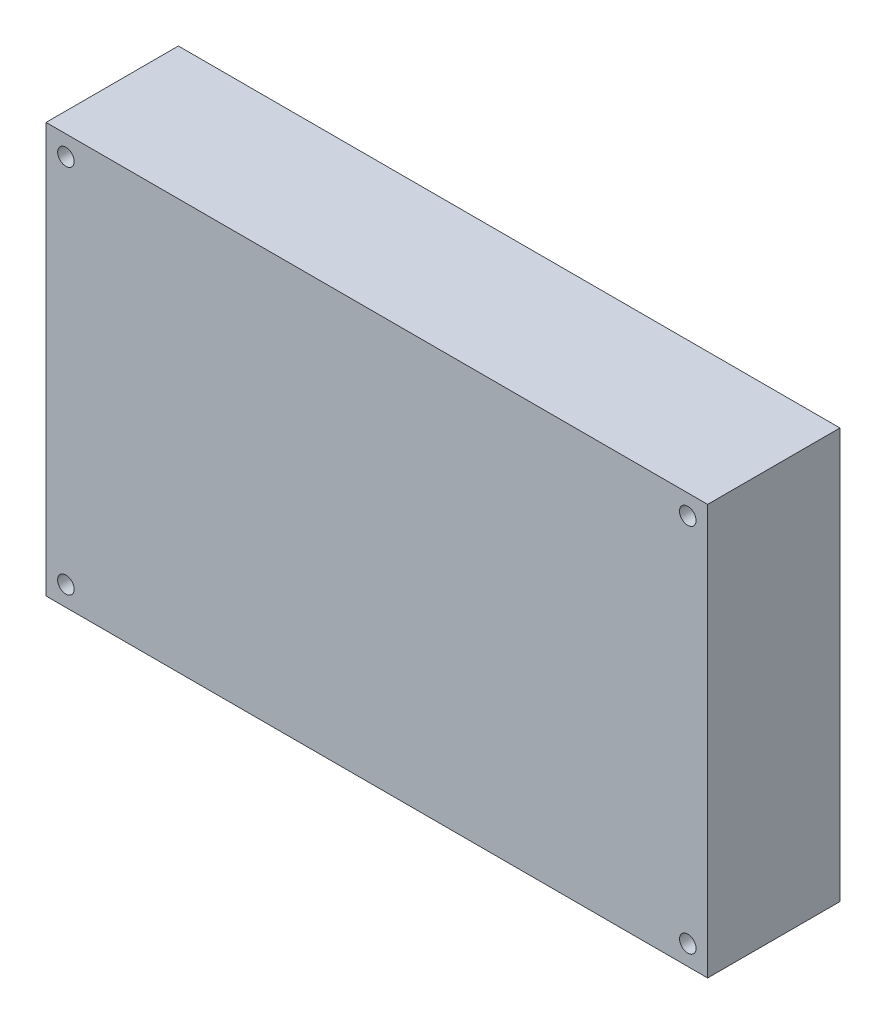
ISO-10303-21;
HEADER;
FILE_DESCRIPTION(('STEP AP214'),'2;1');
FILE_NAME('part.step','',(''),(''),'','','');
FILE_SCHEMA(('AUTOMOTIVE_DESIGN { 1 0 10303 214 1 1 1 1 }'));
ENDSEC;
DATA;
#1=APPLICATION_CONTEXT('core data for automotive mechanical design processes');
#2=APPLICATION_PROTOCOL_DEFINITION('international standard','automotive_design',2000,#1);
#3=PRODUCT_CONTEXT('',#1,'mechanical');
#4=PRODUCT('Part','Part','',(#3));
#5=PRODUCT_RELATED_PRODUCT_CATEGORY('part','',(#4));
#6=PRODUCT_DEFINITION_FORMATION('','',#4);
#7=PRODUCT_DEFINITION_CONTEXT('part definition',#1,'design');
#8=PRODUCT_DEFINITION('design','',#6,#7);
#9=PRODUCT_DEFINITION_SHAPE('','',#8);
#10=(LENGTH_UNIT() NAMED_UNIT(*) SI_UNIT(.MILLI.,.METRE.));
#11=(NAMED_UNIT(*) PLANE_ANGLE_UNIT() SI_UNIT($,.RADIAN.));
#12=(NAMED_UNIT(*) SI_UNIT($,.STERADIAN.) SOLID_ANGLE_UNIT());
#13=UNCERTAINTY_MEASURE_WITH_UNIT(LENGTH_MEASURE(1.E-05),#10,'distance_accuracy_value','');
#14=(GEOMETRIC_REPRESENTATION_CONTEXT(3) GLOBAL_UNCERTAINTY_ASSIGNED_CONTEXT((#13)) GLOBAL_UNIT_ASSIGNED_CONTEXT((#10,
#11,#12)) REPRESENTATION_CONTEXT('',''));
#15=CARTESIAN_POINT('',(0.,0.,0.));
#16=DIRECTION('',(0.,0.,1.));
#17=DIRECTION('',(1.,0.,0.));
#18=AXIS2_PLACEMENT_3D('',#15,#16,#17);
#19=CARTESIAN_POINT('',(50.,-31.,20.));
#20=DIRECTION('',(-1.,0.,0.));
#21=DIRECTION('',(0.,0.,1.));
#22=AXIS2_PLACEMENT_3D('',#19,#20,#21);
#23=PLANE('',#22);
#24=DIRECTION('',(0.,1.,0.));
#25=VECTOR('',#24,1.);
#26=CARTESIAN_POINT('',(50.,-31.,0.));
#27=LINE('',#26,#25);
#28=CARTESIAN_POINT('',(50.,-31.,0.));
#29=VERTEX_POINT('',#28);
#30=CARTESIAN_POINT('',(50.,31.,0.));
#31=VERTEX_POINT('',#30);
#32=EDGE_CURVE('E109',#29,#31,#27,.T.);
#33=ORIENTED_EDGE('',*,*,#32,.T.);
#34=DIRECTION('',(0.,0.,-1.));
#35=VECTOR('',#34,1.);
#36=CARTESIAN_POINT('',(50.,31.,20.));
#37=LINE('',#36,#35);
#38=CARTESIAN_POINT('',(50.,31.,20.));
#39=VERTEX_POINT('',#38);
#40=EDGE_CURVE('E11',#39,#31,#37,.T.);
#41=ORIENTED_EDGE('',*,*,#40,.F.);
#42=DIRECTION('',(0.,1.,0.));
#43=VECTOR('',#42,1.);
#44=CARTESIAN_POINT('',(50.,-31.,20.));
#45=LINE('',#44,#43);
#46=CARTESIAN_POINT('',(50.,-31.,20.));
#47=VERTEX_POINT('',#46);
#48=EDGE_CURVE('E93',#47,#39,#45,.T.);
#49=ORIENTED_EDGE('',*,*,#48,.F.);
#50=DIRECTION('',(0.,0.,-1.));
#51=VECTOR('',#50,1.);
#52=CARTESIAN_POINT('',(50.,-31.,20.));
#53=LINE('',#52,#51);
#54=EDGE_CURVE('E105',#47,#29,#53,.T.);
#55=ORIENTED_EDGE('',*,*,#54,.T.);
#56=EDGE_LOOP('',(#33,#41,#49,#55));
#57=FACE_BOUND('',#56,.T.);
#58=ADVANCED_FACE('F41',(#57),#23,.F.);
#59=CARTESIAN_POINT('',(-50.,31.,20.));
#60=DIRECTION('',(0.,-1.,0.));
#61=DIRECTION('',(1.,0.,0.));
#62=AXIS2_PLACEMENT_3D('',#59,#60,#61);
#63=PLANE('',#62);
#64=DIRECTION('',(-1.,0.,0.));
#65=VECTOR('',#64,1.);
#66=CARTESIAN_POINT('',(-50.,31.,0.));
#67=LINE('',#66,#65);
#68=CARTESIAN_POINT('',(-50.,31.,0.));
#69=VERTEX_POINT('',#68);
#70=EDGE_CURVE('E98',#31,#69,#67,.T.);
#71=ORIENTED_EDGE('',*,*,#70,.T.);
#72=DIRECTION('',(0.,0.,-1.));
#73=VECTOR('',#72,1.);
#74=CARTESIAN_POINT('',(-50.,31.,20.));
#75=LINE('',#74,#73);
#76=CARTESIAN_POINT('',(-50.,31.,20.));
#77=VERTEX_POINT('',#76);
#78=EDGE_CURVE('E50',#77,#69,#75,.T.);
#79=ORIENTED_EDGE('',*,*,#78,.F.);
#80=DIRECTION('',(-1.,0.,0.));
#81=VECTOR('',#80,1.);
#82=CARTESIAN_POINT('',(-50.,31.,20.));
#83=LINE('',#82,#81);
#84=EDGE_CURVE('E88',#39,#77,#83,.T.);
#85=ORIENTED_EDGE('',*,*,#84,.F.);
#86=ORIENTED_EDGE('',*,*,#40,.T.);
#87=EDGE_LOOP('',(#71,#79,#85,#86));
#88=FACE_BOUND('',#87,.T.);
#89=ADVANCED_FACE('F97',(#88),#63,.F.);
#90=CARTESIAN_POINT('',(-50.,-31.,20.));
#91=DIRECTION('',(1.,0.,0.));
#92=DIRECTION('',(0.,0.,-1.));
#93=AXIS2_PLACEMENT_3D('',#90,#91,#92);
#94=PLANE('',#93);
#95=DIRECTION('',(0.,-1.,0.));
#96=VECTOR('',#95,1.);
#97=CARTESIAN_POINT('',(-50.,-31.,0.));
#98=LINE('',#97,#96);
#99=CARTESIAN_POINT('',(-50.,-31.,0.));
#100=VERTEX_POINT('',#99);
#101=EDGE_CURVE('E75',#69,#100,#98,.T.);
#102=ORIENTED_EDGE('',*,*,#101,.T.);
#103=DIRECTION('',(0.,0.,-1.));
#104=VECTOR('',#103,1.);
#105=CARTESIAN_POINT('',(-50.,-31.,20.));
#106=LINE('',#105,#104);
#107=CARTESIAN_POINT('',(-50.,-31.,20.));
#108=VERTEX_POINT('',#107);
#109=EDGE_CURVE('E100',#108,#100,#106,.T.);
#110=ORIENTED_EDGE('',*,*,#109,.F.);
#111=DIRECTION('',(0.,-1.,0.));
#112=VECTOR('',#111,1.);
#113=CARTESIAN_POINT('',(-50.,-31.,20.));
#114=LINE('',#113,#112);
#115=EDGE_CURVE('E91',#77,#108,#114,.T.);
#116=ORIENTED_EDGE('',*,*,#115,.F.);
#117=ORIENTED_EDGE('',*,*,#78,.T.);
#118=EDGE_LOOP('',(#102,#110,#116,#117));
#119=FACE_BOUND('',#118,.T.);
#120=ADVANCED_FACE('F101',(#119),#94,.F.);
#121=CARTESIAN_POINT('',(-50.,-31.,20.));
#122=DIRECTION('',(0.,1.,0.));
#123=DIRECTION('',(-1.,0.,0.));
#124=AXIS2_PLACEMENT_3D('',#121,#122,#123);
#125=PLANE('',#124);
#126=DIRECTION('',(1.,0.,0.));
#127=VECTOR('',#126,1.);
#128=CARTESIAN_POINT('',(-50.,-31.,0.));
#129=LINE('',#128,#127);
#130=EDGE_CURVE('E81',#100,#29,#129,.T.);
#131=ORIENTED_EDGE('',*,*,#130,.T.);
#132=ORIENTED_EDGE('',*,*,#54,.F.);
#133=DIRECTION('',(1.,0.,0.));
#134=VECTOR('',#133,1.);
#135=CARTESIAN_POINT('',(-50.,-31.,20.));
#136=LINE('',#135,#134);
#137=EDGE_CURVE('E58',#108,#47,#136,.T.);
#138=ORIENTED_EDGE('',*,*,#137,.F.);
#139=ORIENTED_EDGE('',*,*,#109,.T.);
#140=EDGE_LOOP('',(#131,#132,#138,#139));
#141=FACE_BOUND('',#140,.T.);
#142=ADVANCED_FACE('F123',(#141),#125,.F.);
#143=CARTESIAN_POINT('',(0.,0.,20.));
#144=DIRECTION('',(0.,0.,-1.));
#145=DIRECTION('',(-1.,0.,0.));
#146=AXIS2_PLACEMENT_3D('',#143,#144,#145);
#147=PLANE('',#146);
#148=CARTESIAN_POINT('',(-47.,28.,20.));
#149=DIRECTION('',(0.,0.,1.));
#150=DIRECTION('',(1.,0.,0.));
#151=AXIS2_PLACEMENT_3D('',#148,#149,#150);
#152=CIRCLE('',#151,1.24999999999999);
#153=CARTESIAN_POINT('',(-45.75,28.,20.));
#154=VERTEX_POINT('',#153);
#155=EDGE_CURVE('E157',#154,#154,#152,.T.);
#156=ORIENTED_EDGE('',*,*,#155,.F.);
#157=EDGE_LOOP('',(#156));
#158=FACE_BOUND('',#157,.T.);
#159=CARTESIAN_POINT('',(-47.,-28.,20.));
#160=DIRECTION('',(0.,0.,1.));
#161=DIRECTION('',(1.,0.,0.));
#162=AXIS2_PLACEMENT_3D('',#159,#160,#161);
#163=CIRCLE('',#162,1.24999999999999);
#164=CARTESIAN_POINT('',(-45.75,-28.,20.));
#165=VERTEX_POINT('',#164);
#166=EDGE_CURVE('E149',#165,#165,#163,.T.);
#167=ORIENTED_EDGE('',*,*,#166,.F.);
#168=EDGE_LOOP('',(#167));
#169=FACE_BOUND('',#168,.T.);
#170=CARTESIAN_POINT('',(47.,-28.,20.));
#171=DIRECTION('',(0.,0.,1.));
#172=DIRECTION('',(1.,0.,0.));
#173=AXIS2_PLACEMENT_3D('',#170,#171,#172);
#174=CIRCLE('',#173,1.24999999999999);
#175=CARTESIAN_POINT('',(48.25,-28.,20.));
#176=VERTEX_POINT('',#175);
#177=EDGE_CURVE('E141',#176,#176,#174,.T.);
#178=ORIENTED_EDGE('',*,*,#177,.F.);
#179=EDGE_LOOP('',(#178));
#180=FACE_BOUND('',#179,.T.);
#181=CARTESIAN_POINT('',(47.,28.,20.));
#182=DIRECTION('',(0.,0.,1.));
#183=DIRECTION('',(1.,0.,0.));
#184=AXIS2_PLACEMENT_3D('',#181,#182,#183);
#185=CIRCLE('',#184,1.24999999999999);
#186=CARTESIAN_POINT('',(48.25,28.,20.));
#187=VERTEX_POINT('',#186);
#188=EDGE_CURVE('E133',#187,#187,#185,.T.);
#189=ORIENTED_EDGE('',*,*,#188,.F.);
#190=EDGE_LOOP('',(#189));
#191=FACE_BOUND('',#190,.T.);
#192=ORIENTED_EDGE('',*,*,#48,.T.);
#193=ORIENTED_EDGE('',*,*,#84,.T.);
#194=ORIENTED_EDGE('',*,*,#115,.T.);
#195=ORIENTED_EDGE('',*,*,#137,.T.);
#196=EDGE_LOOP('',(#192,#193,#194,#195));
#197=FACE_BOUND('',#196,.T.);
#198=ADVANCED_FACE('F89',(#158,#169,#180,#191,#197),#147,.F.);
#199=CARTESIAN_POINT('',(0.,0.,0.));
#200=DIRECTION('',(0.,0.,-1.));
#201=DIRECTION('',(-1.,0.,0.));
#202=AXIS2_PLACEMENT_3D('',#199,#200,#201);
#203=PLANE('',#202);
#204=CARTESIAN_POINT('',(-47.,28.,0.));
#205=DIRECTION('',(0.,0.,1.));
#206=DIRECTION('',(1.,0.,0.));
#207=AXIS2_PLACEMENT_3D('',#204,#205,#206);
#208=CIRCLE('',#207,1.24999999999999);
#209=CARTESIAN_POINT('',(-45.75,28.,0.));
#210=VERTEX_POINT('',#209);
#211=EDGE_CURVE('E153',#210,#210,#208,.T.);
#212=ORIENTED_EDGE('',*,*,#211,.T.);
#213=EDGE_LOOP('',(#212));
#214=FACE_BOUND('',#213,.T.);
#215=CARTESIAN_POINT('',(-47.,-28.,0.));
#216=DIRECTION('',(0.,0.,1.));
#217=DIRECTION('',(1.,0.,0.));
#218=AXIS2_PLACEMENT_3D('',#215,#216,#217);
#219=CIRCLE('',#218,1.24999999999999);
#220=CARTESIAN_POINT('',(-45.75,-28.,0.));
#221=VERTEX_POINT('',#220);
#222=EDGE_CURVE('E145',#221,#221,#219,.T.);
#223=ORIENTED_EDGE('',*,*,#222,.T.);
#224=EDGE_LOOP('',(#223));
#225=FACE_BOUND('',#224,.T.);
#226=CARTESIAN_POINT('',(47.,-28.,0.));
#227=DIRECTION('',(0.,0.,1.));
#228=DIRECTION('',(1.,0.,0.));
#229=AXIS2_PLACEMENT_3D('',#226,#227,#228);
#230=CIRCLE('',#229,1.24999999999999);
#231=CARTESIAN_POINT('',(48.25,-28.,0.));
#232=VERTEX_POINT('',#231);
#233=EDGE_CURVE('E137',#232,#232,#230,.T.);
#234=ORIENTED_EDGE('',*,*,#233,.T.);
#235=EDGE_LOOP('',(#234));
#236=FACE_BOUND('',#235,.T.);
#237=CARTESIAN_POINT('',(47.,28.,0.));
#238=DIRECTION('',(0.,0.,1.));
#239=DIRECTION('',(1.,0.,0.));
#240=AXIS2_PLACEMENT_3D('',#237,#238,#239);
#241=CIRCLE('',#240,1.24999999999999);
#242=CARTESIAN_POINT('',(48.25,28.,0.));
#243=VERTEX_POINT('',#242);
#244=EDGE_CURVE('E113',#243,#243,#241,.T.);
#245=ORIENTED_EDGE('',*,*,#244,.T.);
#246=EDGE_LOOP('',(#245));
#247=FACE_BOUND('',#246,.T.);
#248=ORIENTED_EDGE('',*,*,#32,.F.);
#249=ORIENTED_EDGE('',*,*,#130,.F.);
#250=ORIENTED_EDGE('',*,*,#101,.F.);
#251=ORIENTED_EDGE('',*,*,#70,.F.);
#252=EDGE_LOOP('',(#248,#249,#250,#251));
#253=FACE_BOUND('',#252,.T.);
#254=ADVANCED_FACE('F126',(#214,#225,#236,#247,#253),#203,.T.);
#255=CARTESIAN_POINT('',(47.,28.,20.));
#256=DIRECTION('',(0.,0.,1.));
#257=DIRECTION('',(1.,0.,0.));
#258=AXIS2_PLACEMENT_3D('',#255,#256,#257);
#259=CYLINDRICAL_SURFACE('',#258,1.24999999999999);
#260=ORIENTED_EDGE('',*,*,#244,.F.);
#261=EDGE_LOOP('',(#260));
#262=FACE_BOUND('',#261,.T.);
#263=ORIENTED_EDGE('',*,*,#188,.T.);
#264=EDGE_LOOP('',(#263));
#265=FACE_BOUND('',#264,.T.);
#266=ADVANCED_FACE('F173',(#262,#265),#259,.F.);
#267=CARTESIAN_POINT('',(47.,-28.,20.));
#268=DIRECTION('',(0.,0.,1.));
#269=DIRECTION('',(1.,0.,0.));
#270=AXIS2_PLACEMENT_3D('',#267,#268,#269);
#271=CYLINDRICAL_SURFACE('',#270,1.24999999999999);
#272=ORIENTED_EDGE('',*,*,#233,.F.);
#273=EDGE_LOOP('',(#272));
#274=FACE_BOUND('',#273,.T.);
#275=ORIENTED_EDGE('',*,*,#177,.T.);
#276=EDGE_LOOP('',(#275));
#277=FACE_BOUND('',#276,.T.);
#278=ADVANCED_FACE('F175',(#274,#277),#271,.F.);
#279=CARTESIAN_POINT('',(-47.,-28.,20.));
#280=DIRECTION('',(0.,0.,1.));
#281=DIRECTION('',(1.,0.,0.));
#282=AXIS2_PLACEMENT_3D('',#279,#280,#281);
#283=CYLINDRICAL_SURFACE('',#282,1.24999999999999);
#284=ORIENTED_EDGE('',*,*,#222,.F.);
#285=EDGE_LOOP('',(#284));
#286=FACE_BOUND('',#285,.T.);
#287=ORIENTED_EDGE('',*,*,#166,.T.);
#288=EDGE_LOOP('',(#287));
#289=FACE_BOUND('',#288,.T.);
#290=ADVANCED_FACE('F182',(#286,#289),#283,.F.);
#291=CARTESIAN_POINT('',(-47.,28.,20.));
#292=DIRECTION('',(0.,0.,1.));
#293=DIRECTION('',(1.,0.,0.));
#294=AXIS2_PLACEMENT_3D('',#291,#292,#293);
#295=CYLINDRICAL_SURFACE('',#294,1.24999999999999);
#296=ORIENTED_EDGE('',*,*,#211,.F.);
#297=EDGE_LOOP('',(#296));
#298=FACE_BOUND('',#297,.T.);
#299=ORIENTED_EDGE('',*,*,#155,.T.);
#300=EDGE_LOOP('',(#299));
#301=FACE_BOUND('',#300,.T.);
#302=ADVANCED_FACE('F162',(#298,#301),#295,.F.);
#303=CLOSED_SHELL('',(#58,#89,#120,#142,#198,#254,#266,#278,#290,#302));
#304=MANIFOLD_SOLID_BREP('B2',#303);
#305=ADVANCED_BREP_SHAPE_REPRESENTATION('',(#18,#304),#14);
#306=SHAPE_DEFINITION_REPRESENTATION(#9,#305);
ENDSEC;
END-ISO-10303-21;
